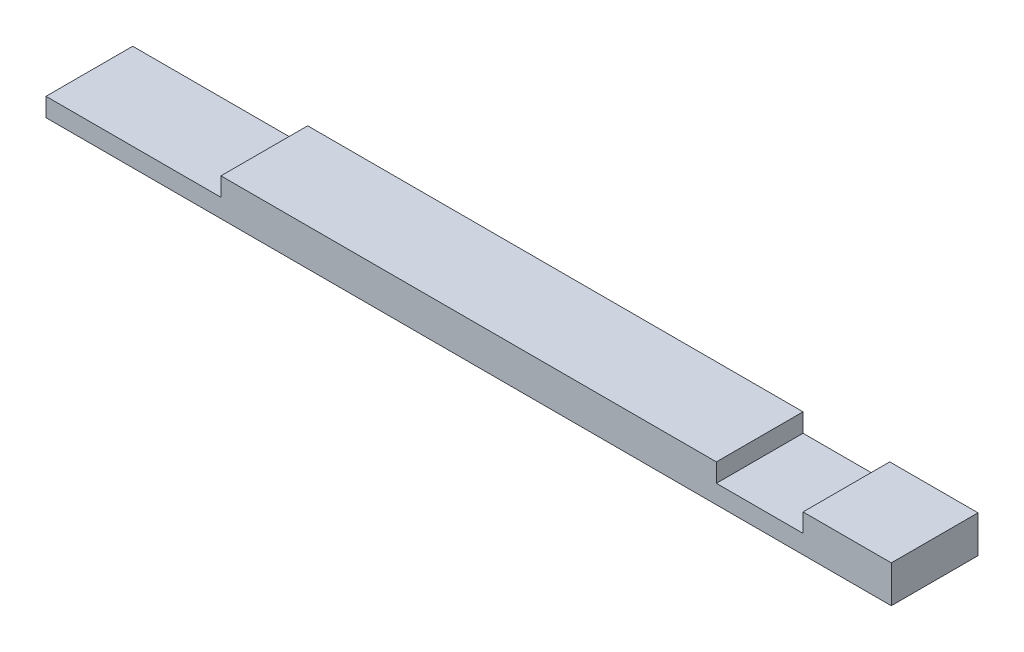
ISO-10303-21;
HEADER;
FILE_DESCRIPTION(('STEP AP214'),'2;1');
FILE_NAME('part.step','',(''),(''),'','','');
FILE_SCHEMA(('AUTOMOTIVE_DESIGN { 1 0 10303 214 1 1 1 1 }'));
ENDSEC;
DATA;
#1=APPLICATION_CONTEXT('core data for automotive mechanical design processes');
#2=APPLICATION_PROTOCOL_DEFINITION('international standard','automotive_design',2000,#1);
#3=PRODUCT_CONTEXT('',#1,'mechanical');
#4=PRODUCT('Part','Part','',(#3));
#5=PRODUCT_RELATED_PRODUCT_CATEGORY('part','',(#4));
#6=PRODUCT_DEFINITION_FORMATION('','',#4);
#7=PRODUCT_DEFINITION_CONTEXT('part definition',#1,'design');
#8=PRODUCT_DEFINITION('design','',#6,#7);
#9=PRODUCT_DEFINITION_SHAPE('','',#8);
#10=(LENGTH_UNIT() NAMED_UNIT(*) SI_UNIT(.MILLI.,.METRE.));
#11=(NAMED_UNIT(*) PLANE_ANGLE_UNIT() SI_UNIT($,.RADIAN.));
#12=(NAMED_UNIT(*) SI_UNIT($,.STERADIAN.) SOLID_ANGLE_UNIT());
#13=UNCERTAINTY_MEASURE_WITH_UNIT(LENGTH_MEASURE(1.E-05),#10,'distance_accuracy_value','');
#14=(GEOMETRIC_REPRESENTATION_CONTEXT(3) GLOBAL_UNCERTAINTY_ASSIGNED_CONTEXT((#13)) GLOBAL_UNIT_ASSIGNED_CONTEXT((#10,
#11,#12)) REPRESENTATION_CONTEXT('',''));
#15=CARTESIAN_POINT('',(0.,0.,0.));
#16=DIRECTION('',(0.,0.,1.));
#17=DIRECTION('',(1.,0.,0.));
#18=AXIS2_PLACEMENT_3D('',#15,#16,#17);
#19=CARTESIAN_POINT('',(0.,38.1,0.));
#20=DIRECTION('',(1.,0.,0.));
#21=DIRECTION('',(0.,0.,-1.));
#22=AXIS2_PLACEMENT_3D('',#19,#20,#21);
#23=PLANE('',#22);
#24=DIRECTION('',(0.,0.,1.));
#25=VECTOR('',#24,1.);
#26=CARTESIAN_POINT('',(0.,19.05,0.));
#27=LINE('',#26,#25);
#28=CARTESIAN_POINT('',(0.,19.05,-88.9));
#29=VERTEX_POINT('',#28);
#30=CARTESIAN_POINT('',(0.,19.05,0.));
#31=VERTEX_POINT('',#30);
#32=EDGE_CURVE('E180',#29,#31,#27,.T.);
#33=ORIENTED_EDGE('',*,*,#32,.F.);
#34=DIRECTION('',(0.,-1.,0.));
#35=VECTOR('',#34,1.);
#36=CARTESIAN_POINT('',(0.,38.1,-88.9));
#37=LINE('',#36,#35);
#38=CARTESIAN_POINT('',(0.,0.,-88.9));
#39=VERTEX_POINT('',#38);
#40=EDGE_CURVE('E201',#29,#39,#37,.T.);
#41=ORIENTED_EDGE('',*,*,#40,.T.);
#42=DIRECTION('',(0.,0.,1.));
#43=VECTOR('',#42,1.);
#44=CARTESIAN_POINT('',(0.,0.,0.));
#45=LINE('',#44,#43);
#46=CARTESIAN_POINT('',(0.,0.,0.));
#47=VERTEX_POINT('',#46);
#48=EDGE_CURVE('E160',#39,#47,#45,.T.);
#49=ORIENTED_EDGE('',*,*,#48,.T.);
#50=DIRECTION('',(0.,-1.,0.));
#51=VECTOR('',#50,1.);
#52=CARTESIAN_POINT('',(0.,38.1,0.));
#53=LINE('',#52,#51);
#54=EDGE_CURVE('E11',#31,#47,#53,.T.);
#55=ORIENTED_EDGE('',*,*,#54,.F.);
#56=EDGE_LOOP('',(#33,#41,#49,#55));
#57=FACE_BOUND('',#56,.T.);
#58=ADVANCED_FACE('F42',(#57),#23,.F.);
#59=CARTESIAN_POINT('',(0.,38.1,0.));
#60=DIRECTION('',(0.,-1.,0.));
#61=DIRECTION('',(0.,0.,-1.));
#62=AXIS2_PLACEMENT_3D('',#59,#60,#61);
#63=PLANE('',#62);
#64=DIRECTION('',(-1.,0.,0.));
#65=VECTOR('',#64,1.);
#66=CARTESIAN_POINT('',(0.,38.1,-88.9));
#67=LINE('',#66,#65);
#68=CARTESIAN_POINT('',(866.775,38.1,-88.9));
#69=VERTEX_POINT('',#68);
#70=CARTESIAN_POINT('',(776.28750000001,38.1,-88.9));
#71=VERTEX_POINT('',#70);
#72=EDGE_CURVE('E198',#69,#71,#67,.T.);
#73=ORIENTED_EDGE('',*,*,#72,.T.);
#74=DIRECTION('',(0.,0.,-1.));
#75=VECTOR('',#74,1.);
#76=CARTESIAN_POINT('',(776.28750000001,38.1,-4.44089209850063E-13));
#77=LINE('',#76,#75);
#78=CARTESIAN_POINT('',(776.28750000001,38.1,-4.44089209850063E-13));
#79=VERTEX_POINT('',#78);
#80=EDGE_CURVE('E123',#79,#71,#77,.T.);
#81=ORIENTED_EDGE('',*,*,#80,.F.);
#82=DIRECTION('',(1.,0.,0.));
#83=VECTOR('',#82,1.);
#84=CARTESIAN_POINT('',(0.,38.1,0.));
#85=LINE('',#84,#83);
#86=CARTESIAN_POINT('',(866.775,38.1,0.));
#87=VERTEX_POINT('',#86);
#88=EDGE_CURVE('E189',#79,#87,#85,.T.);
#89=ORIENTED_EDGE('',*,*,#88,.T.);
#90=DIRECTION('',(0.,0.,-1.));
#91=VECTOR('',#90,1.);
#92=CARTESIAN_POINT('',(866.775,38.1,0.));
#93=LINE('',#92,#91);
#94=EDGE_CURVE('E194',#87,#69,#93,.T.);
#95=ORIENTED_EDGE('',*,*,#94,.T.);
#96=EDGE_LOOP('',(#73,#81,#89,#95));
#97=FACE_BOUND('',#96,.T.);
#98=ADVANCED_FACE('F238',(#97),#63,.F.);
#99=CARTESIAN_POINT('',(0.,38.1,0.));
#100=DIRECTION('',(0.,0.,-1.));
#101=DIRECTION('',(-1.,0.,0.));
#102=AXIS2_PLACEMENT_3D('',#99,#100,#101);
#103=PLANE('',#102);
#104=ORIENTED_EDGE('',*,*,#88,.F.);
#105=DIRECTION('',(0.,1.,0.));
#106=VECTOR('',#105,1.);
#107=CARTESIAN_POINT('',(776.28750000001,19.05,-4.44089209850063E-13));
#108=LINE('',#107,#106);
#109=CARTESIAN_POINT('',(776.28750000001,19.05,-4.44089209850063E-13));
#110=VERTEX_POINT('',#109);
#111=EDGE_CURVE('E157',#110,#79,#108,.T.);
#112=ORIENTED_EDGE('',*,*,#111,.F.);
#113=DIRECTION('',(1.,0.,0.));
#114=VECTOR('',#113,1.);
#115=CARTESIAN_POINT('',(776.28750000001,19.05,-4.44089209850063E-13));
#116=LINE('',#115,#114);
#117=CARTESIAN_POINT('',(687.387500000011,19.05,-4.44089209850063E-13));
#118=VERTEX_POINT('',#117);
#119=EDGE_CURVE('E129',#118,#110,#116,.T.);
#120=ORIENTED_EDGE('',*,*,#119,.F.);
#121=DIRECTION('',(0.,1.,0.));
#122=VECTOR('',#121,1.);
#123=CARTESIAN_POINT('',(687.387500000011,19.05,-4.44089209850063E-13));
#124=LINE('',#123,#122);
#125=CARTESIAN_POINT('',(687.387500000011,38.1,-4.44089209850063E-13));
#126=VERTEX_POINT('',#125);
#127=EDGE_CURVE('E161',#118,#126,#124,.T.);
#128=ORIENTED_EDGE('',*,*,#127,.T.);
#129=CARTESIAN_POINT('',(179.400200000003,38.1,0.));
#130=VERTEX_POINT('',#129);
#131=EDGE_CURVE('E192',#130,#126,#85,.T.);
#132=ORIENTED_EDGE('',*,*,#131,.F.);
#133=DIRECTION('',(0.,1.,0.));
#134=VECTOR('',#133,1.);
#135=CARTESIAN_POINT('',(179.400200000003,19.05,0.));
#136=LINE('',#135,#134);
#137=CARTESIAN_POINT('',(179.400200000003,19.05,0.));
#138=VERTEX_POINT('',#137);
#139=EDGE_CURVE('E65',#138,#130,#136,.T.);
#140=ORIENTED_EDGE('',*,*,#139,.F.);
#141=DIRECTION('',(1.,0.,0.));
#142=VECTOR('',#141,1.);
#143=CARTESIAN_POINT('',(179.400200000003,19.05,0.));
#144=LINE('',#143,#142);
#145=EDGE_CURVE('E171',#31,#138,#144,.T.);
#146=ORIENTED_EDGE('',*,*,#145,.F.);
#147=ORIENTED_EDGE('',*,*,#54,.T.);
#148=DIRECTION('',(1.,0.,0.));
#149=VECTOR('',#148,1.);
#150=CARTESIAN_POINT('',(0.,0.,0.));
#151=LINE('',#150,#149);
#152=CARTESIAN_POINT('',(866.775,0.,0.));
#153=VERTEX_POINT('',#152);
#154=EDGE_CURVE('E205',#47,#153,#151,.T.);
#155=ORIENTED_EDGE('',*,*,#154,.T.);
#156=DIRECTION('',(0.,-1.,0.));
#157=VECTOR('',#156,1.);
#158=CARTESIAN_POINT('',(866.775,38.1,0.));
#159=LINE('',#158,#157);
#160=EDGE_CURVE('E50',#87,#153,#159,.T.);
#161=ORIENTED_EDGE('',*,*,#160,.F.);
#162=EDGE_LOOP('',(#104,#112,#120,#128,#132,#140,#146,#147,#155,#161));
#163=FACE_BOUND('',#162,.T.);
#164=ADVANCED_FACE('F239',(#163),#103,.F.);
#165=CARTESIAN_POINT('',(866.775,38.1,0.));
#166=DIRECTION('',(-1.,0.,0.));
#167=DIRECTION('',(0.,0.,1.));
#168=AXIS2_PLACEMENT_3D('',#165,#166,#167);
#169=PLANE('',#168);
#170=DIRECTION('',(0.,0.,-1.));
#171=VECTOR('',#170,1.);
#172=CARTESIAN_POINT('',(866.775,0.,0.));
#173=LINE('',#172,#171);
#174=CARTESIAN_POINT('',(866.775,0.,-88.9));
#175=VERTEX_POINT('',#174);
#176=EDGE_CURVE('E208',#153,#175,#173,.T.);
#177=ORIENTED_EDGE('',*,*,#176,.T.);
#178=DIRECTION('',(0.,-1.,0.));
#179=VECTOR('',#178,1.);
#180=CARTESIAN_POINT('',(866.775,38.1,-88.9));
#181=LINE('',#180,#179);
#182=EDGE_CURVE('E216',#69,#175,#181,.T.);
#183=ORIENTED_EDGE('',*,*,#182,.F.);
#184=ORIENTED_EDGE('',*,*,#94,.F.);
#185=ORIENTED_EDGE('',*,*,#160,.T.);
#186=EDGE_LOOP('',(#177,#183,#184,#185));
#187=FACE_BOUND('',#186,.T.);
#188=ADVANCED_FACE('F226',(#187),#169,.F.);
#189=CARTESIAN_POINT('',(0.,38.1,-88.9));
#190=DIRECTION('',(0.,0.,1.));
#191=DIRECTION('',(1.,0.,0.));
#192=AXIS2_PLACEMENT_3D('',#189,#190,#191);
#193=PLANE('',#192);
#194=DIRECTION('',(-1.,0.,0.));
#195=VECTOR('',#194,1.);
#196=CARTESIAN_POINT('',(776.28750000001,19.05,-88.9));
#197=LINE('',#196,#195);
#198=CARTESIAN_POINT('',(776.28750000001,19.05,-88.9));
#199=VERTEX_POINT('',#198);
#200=CARTESIAN_POINT('',(687.387500000011,19.05,-88.9));
#201=VERTEX_POINT('',#200);
#202=EDGE_CURVE('E135',#199,#201,#197,.T.);
#203=ORIENTED_EDGE('',*,*,#202,.F.);
#204=DIRECTION('',(0.,1.,0.));
#205=VECTOR('',#204,1.);
#206=CARTESIAN_POINT('',(776.28750000001,19.05,-88.9));
#207=LINE('',#206,#205);
#208=EDGE_CURVE('E117',#199,#71,#207,.T.);
#209=ORIENTED_EDGE('',*,*,#208,.T.);
#210=ORIENTED_EDGE('',*,*,#72,.F.);
#211=ORIENTED_EDGE('',*,*,#182,.T.);
#212=DIRECTION('',(-1.,0.,0.));
#213=VECTOR('',#212,1.);
#214=CARTESIAN_POINT('',(0.,0.,-88.9));
#215=LINE('',#214,#213);
#216=EDGE_CURVE('E193',#175,#39,#215,.T.);
#217=ORIENTED_EDGE('',*,*,#216,.T.);
#218=ORIENTED_EDGE('',*,*,#40,.F.);
#219=DIRECTION('',(-1.,0.,0.));
#220=VECTOR('',#219,1.);
#221=CARTESIAN_POINT('',(179.400200000003,19.05,-88.9));
#222=LINE('',#221,#220);
#223=CARTESIAN_POINT('',(179.400200000003,19.05,-88.9));
#224=VERTEX_POINT('',#223);
#225=EDGE_CURVE('E183',#224,#29,#222,.T.);
#226=ORIENTED_EDGE('',*,*,#225,.F.);
#227=DIRECTION('',(0.,1.,0.));
#228=VECTOR('',#227,1.);
#229=CARTESIAN_POINT('',(179.400200000003,19.05,-88.9));
#230=LINE('',#229,#228);
#231=CARTESIAN_POINT('',(179.400200000003,38.1,-88.9));
#232=VERTEX_POINT('',#231);
#233=EDGE_CURVE('E167',#224,#232,#230,.T.);
#234=ORIENTED_EDGE('',*,*,#233,.T.);
#235=CARTESIAN_POINT('',(687.38750000001,38.1,-88.9));
#236=VERTEX_POINT('',#235);
#237=EDGE_CURVE('E197',#236,#232,#67,.T.);
#238=ORIENTED_EDGE('',*,*,#237,.F.);
#239=DIRECTION('',(0.,1.,0.));
#240=VECTOR('',#239,1.);
#241=CARTESIAN_POINT('',(687.387500000011,19.05,-88.9));
#242=LINE('',#241,#240);
#243=EDGE_CURVE('E57',#201,#236,#242,.T.);
#244=ORIENTED_EDGE('',*,*,#243,.F.);
#245=EDGE_LOOP('',(#203,#209,#210,#211,#217,#218,#226,#234,#238,#244));
#246=FACE_BOUND('',#245,.T.);
#247=ADVANCED_FACE('F141',(#246),#193,.F.);
#248=ORIENTED_EDGE('',*,*,#131,.T.);
#249=DIRECTION('',(0.,0.,1.));
#250=VECTOR('',#249,1.);
#251=CARTESIAN_POINT('',(687.387500000011,38.1,-4.44089209850063E-13));
#252=LINE('',#251,#250);
#253=EDGE_CURVE('E139',#236,#126,#252,.T.);
#254=ORIENTED_EDGE('',*,*,#253,.F.);
#255=ORIENTED_EDGE('',*,*,#237,.T.);
#256=DIRECTION('',(0.,0.,-1.));
#257=VECTOR('',#256,1.);
#258=CARTESIAN_POINT('',(179.400200000003,38.1,0.));
#259=LINE('',#258,#257);
#260=EDGE_CURVE('E154',#130,#232,#259,.T.);
#261=ORIENTED_EDGE('',*,*,#260,.F.);
#262=EDGE_LOOP('',(#248,#254,#255,#261));
#263=FACE_BOUND('',#262,.T.);
#264=ADVANCED_FACE('F243',(#263),#63,.F.);
#265=CARTESIAN_POINT('',(0.,0.,0.));
#266=DIRECTION('',(0.,-1.,0.));
#267=DIRECTION('',(0.,0.,-1.));
#268=AXIS2_PLACEMENT_3D('',#265,#266,#267);
#269=PLANE('',#268);
#270=ORIENTED_EDGE('',*,*,#48,.F.);
#271=ORIENTED_EDGE('',*,*,#216,.F.);
#272=ORIENTED_EDGE('',*,*,#176,.F.);
#273=ORIENTED_EDGE('',*,*,#154,.F.);
#274=EDGE_LOOP('',(#270,#271,#272,#273));
#275=FACE_BOUND('',#274,.T.);
#276=ADVANCED_FACE('F234',(#275),#269,.T.);
#277=CARTESIAN_POINT('',(179.400200000003,19.05,0.));
#278=DIRECTION('',(1.,0.,0.));
#279=DIRECTION('',(0.,0.,-1.));
#280=AXIS2_PLACEMENT_3D('',#277,#278,#279);
#281=PLANE('',#280);
#282=ORIENTED_EDGE('',*,*,#260,.T.);
#283=ORIENTED_EDGE('',*,*,#233,.F.);
#284=DIRECTION('',(0.,0.,-1.));
#285=VECTOR('',#284,1.);
#286=CARTESIAN_POINT('',(179.400200000003,19.05,0.));
#287=LINE('',#286,#285);
#288=EDGE_CURVE('E176',#138,#224,#287,.T.);
#289=ORIENTED_EDGE('',*,*,#288,.F.);
#290=ORIENTED_EDGE('',*,*,#139,.T.);
#291=EDGE_LOOP('',(#282,#283,#289,#290));
#292=FACE_BOUND('',#291,.T.);
#293=ADVANCED_FACE('F264',(#292),#281,.F.);
#294=CARTESIAN_POINT('',(0.,19.05,0.));
#295=DIRECTION('',(0.,1.,0.));
#296=DIRECTION('',(0.,0.,1.));
#297=AXIS2_PLACEMENT_3D('',#294,#295,#296);
#298=PLANE('',#297);
#299=ORIENTED_EDGE('',*,*,#288,.T.);
#300=ORIENTED_EDGE('',*,*,#225,.T.);
#301=ORIENTED_EDGE('',*,*,#32,.T.);
#302=ORIENTED_EDGE('',*,*,#145,.T.);
#303=EDGE_LOOP('',(#299,#300,#301,#302));
#304=FACE_BOUND('',#303,.T.);
#305=ADVANCED_FACE('F266',(#304),#298,.T.);
#306=CARTESIAN_POINT('',(776.28750000001,19.05,-4.44089209850063E-13));
#307=DIRECTION('',(1.,0.,0.));
#308=DIRECTION('',(0.,0.,-1.));
#309=AXIS2_PLACEMENT_3D('',#306,#307,#308);
#310=PLANE('',#309);
#311=ORIENTED_EDGE('',*,*,#80,.T.);
#312=ORIENTED_EDGE('',*,*,#208,.F.);
#313=DIRECTION('',(0.,0.,-1.));
#314=VECTOR('',#313,1.);
#315=CARTESIAN_POINT('',(776.28750000001,19.05,-4.44089209850063E-13));
#316=LINE('',#315,#314);
#317=EDGE_CURVE('E120',#110,#199,#316,.T.);
#318=ORIENTED_EDGE('',*,*,#317,.F.);
#319=ORIENTED_EDGE('',*,*,#111,.T.);
#320=EDGE_LOOP('',(#311,#312,#318,#319));
#321=FACE_BOUND('',#320,.T.);
#322=ADVANCED_FACE('F119',(#321),#310,.F.);
#323=CARTESIAN_POINT('',(687.387500000011,19.05,-4.44089209850063E-13));
#324=DIRECTION('',(-1.,0.,0.));
#325=DIRECTION('',(0.,0.,1.));
#326=AXIS2_PLACEMENT_3D('',#323,#324,#325);
#327=PLANE('',#326);
#328=ORIENTED_EDGE('',*,*,#253,.T.);
#329=ORIENTED_EDGE('',*,*,#127,.F.);
#330=DIRECTION('',(0.,0.,1.));
#331=VECTOR('',#330,1.);
#332=CARTESIAN_POINT('',(687.387500000011,19.05,-4.44089209850063E-13));
#333=LINE('',#332,#331);
#334=EDGE_CURVE('E144',#201,#118,#333,.T.);
#335=ORIENTED_EDGE('',*,*,#334,.F.);
#336=ORIENTED_EDGE('',*,*,#243,.T.);
#337=EDGE_LOOP('',(#328,#329,#335,#336));
#338=FACE_BOUND('',#337,.T.);
#339=ADVANCED_FACE('F335',(#338),#327,.F.);
#340=CARTESIAN_POINT('',(0.,19.05,0.));
#341=DIRECTION('',(0.,1.,0.));
#342=DIRECTION('',(0.,0.,1.));
#343=AXIS2_PLACEMENT_3D('',#340,#341,#342);
#344=PLANE('',#343);
#345=ORIENTED_EDGE('',*,*,#317,.T.);
#346=ORIENTED_EDGE('',*,*,#202,.T.);
#347=ORIENTED_EDGE('',*,*,#334,.T.);
#348=ORIENTED_EDGE('',*,*,#119,.T.);
#349=EDGE_LOOP('',(#345,#346,#347,#348));
#350=FACE_BOUND('',#349,.T.);
#351=ADVANCED_FACE('F133',(#350),#344,.T.);
#352=CLOSED_SHELL('',(#58,#98,#164,#188,#247,#264,#276,#293,#305,#322,#339,#351));
#353=MANIFOLD_SOLID_BREP('B2',#352);
#354=ADVANCED_BREP_SHAPE_REPRESENTATION('',(#18,#353),#14);
#355=SHAPE_DEFINITION_REPRESENTATION(#9,#354);
ENDSEC;
END-ISO-10303-21;
